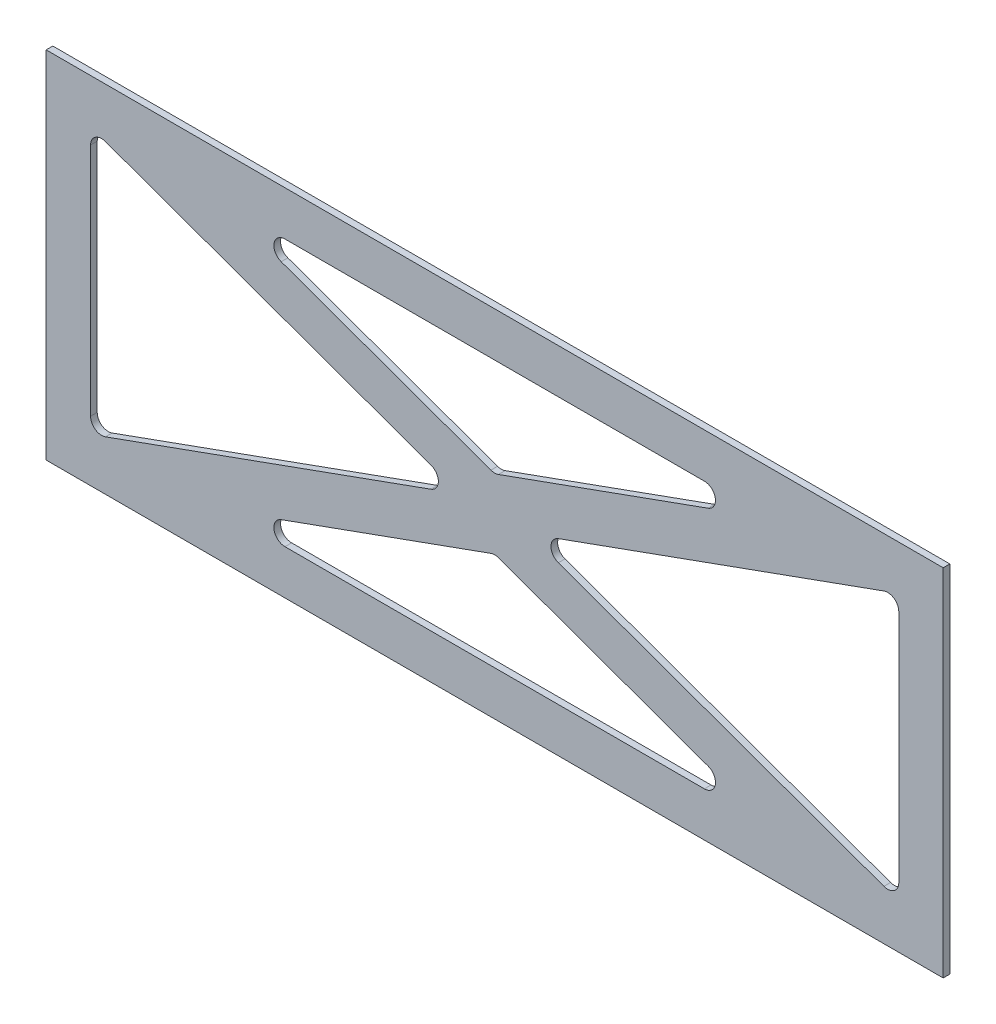
ISO-10303-21;
HEADER;
FILE_DESCRIPTION(('STEP AP214'),'2;1');
FILE_NAME('part.step','',(''),(''),'','','');
FILE_SCHEMA(('AUTOMOTIVE_DESIGN { 1 0 10303 214 1 1 1 1 }'));
ENDSEC;
DATA;
#1=APPLICATION_CONTEXT('core data for automotive mechanical design processes');
#2=APPLICATION_PROTOCOL_DEFINITION('international standard','automotive_design',2000,#1);
#3=PRODUCT_CONTEXT('',#1,'mechanical');
#4=PRODUCT('Part','Part','',(#3));
#5=PRODUCT_RELATED_PRODUCT_CATEGORY('part','',(#4));
#6=PRODUCT_DEFINITION_FORMATION('','',#4);
#7=PRODUCT_DEFINITION_CONTEXT('part definition',#1,'design');
#8=PRODUCT_DEFINITION('design','',#6,#7);
#9=PRODUCT_DEFINITION_SHAPE('','',#8);
#10=(LENGTH_UNIT() NAMED_UNIT(*) SI_UNIT(.MILLI.,.METRE.));
#11=(NAMED_UNIT(*) PLANE_ANGLE_UNIT() SI_UNIT($,.RADIAN.));
#12=(NAMED_UNIT(*) SI_UNIT($,.STERADIAN.) SOLID_ANGLE_UNIT());
#13=UNCERTAINTY_MEASURE_WITH_UNIT(LENGTH_MEASURE(1.E-05),#10,'distance_accuracy_value','');
#14=(GEOMETRIC_REPRESENTATION_CONTEXT(3) GLOBAL_UNCERTAINTY_ASSIGNED_CONTEXT((#13)) GLOBAL_UNIT_ASSIGNED_CONTEXT((#10,
#11,#12)) REPRESENTATION_CONTEXT('',''));
#15=CARTESIAN_POINT('',(0.,0.,0.));
#16=DIRECTION('',(0.,0.,1.));
#17=DIRECTION('',(1.,0.,0.));
#18=AXIS2_PLACEMENT_3D('',#15,#16,#17);
#19=CARTESIAN_POINT('',(0.,0.,154.999999999998));
#20=DIRECTION('',(0.,0.,1.));
#21=DIRECTION('',(1.,0.,0.));
#22=AXIS2_PLACEMENT_3D('',#19,#20,#21);
#23=PLANE('',#22);
#24=DIRECTION('',(0.,-1.,0.));
#25=VECTOR('',#24,1.);
#26=CARTESIAN_POINT('',(-67.5000000000117,-5.9413417365057,154.999999999998));
#27=LINE('',#26,#25);
#28=CARTESIAN_POINT('',(-67.5000000000117,-5.9413417365057,154.999999999998));
#29=VERTEX_POINT('',#28);
#30=CARTESIAN_POINT('',(-67.5000000000117,-165.941341736506,154.999999999998));
#31=VERTEX_POINT('',#30);
#32=EDGE_CURVE('E410',#29,#31,#27,.T.);
#33=ORIENTED_EDGE('',*,*,#32,.T.);
#34=DIRECTION('',(1.,0.,0.));
#35=VECTOR('',#34,1.);
#36=CARTESIAN_POINT('',(-67.5000000000117,-165.941341736506,154.999999999998));
#37=LINE('',#36,#35);
#38=CARTESIAN_POINT('',(336.499999999989,-165.941341736506,154.999999999998));
#39=VERTEX_POINT('',#38);
#40=EDGE_CURVE('E413',#31,#39,#37,.T.);
#41=ORIENTED_EDGE('',*,*,#40,.T.);
#42=DIRECTION('',(0.,1.,0.));
#43=VECTOR('',#42,1.);
#44=CARTESIAN_POINT('',(336.499999999989,-5.9413417365057,154.999999999998));
#45=LINE('',#44,#43);
#46=CARTESIAN_POINT('',(336.499999999989,-5.9413417365057,154.999999999998));
#47=VERTEX_POINT('',#46);
#48=EDGE_CURVE('E416',#39,#47,#45,.T.);
#49=ORIENTED_EDGE('',*,*,#48,.T.);
#50=DIRECTION('',(-1.,0.,0.));
#51=VECTOR('',#50,1.);
#52=CARTESIAN_POINT('',(-67.5000000000117,-5.9413417365057,154.999999999998));
#53=LINE('',#52,#51);
#54=EDGE_CURVE('E418',#47,#29,#53,.T.);
#55=ORIENTED_EDGE('',*,*,#54,.T.);
#56=EDGE_LOOP('',(#33,#41,#49,#55));
#57=FACE_BOUND('',#56,.T.);
#58=DIRECTION('',(0.940697615357116,0.339246218050305,0.));
#59=VECTOR('',#58,1.);
#60=CARTESIAN_POINT('',(105.831987612657,-90.6448298132913,154.999999999998));
#61=LINE('',#60,#59);
#62=CARTESIAN_POINT('',(-40.8037689097602,-143.526462570796,154.999999999998));
#63=VERTEX_POINT('',#62);
#64=CARTESIAN_POINT('',(105.831987612657,-90.6448298132913,154.999999999998));
#65=VERTEX_POINT('',#64);
#66=EDGE_CURVE('E367',#63,#65,#61,.T.);
#67=ORIENTED_EDGE('',*,*,#66,.F.);
#68=CARTESIAN_POINT('',(-42.5000000000117,-138.82297449401,154.999999999998));
#69=DIRECTION('',(0.,0.,1.));
#70=DIRECTION('',(-1.,0.,0.));
#71=AXIS2_PLACEMENT_3D('',#68,#69,#70);
#72=CIRCLE('',#71,4.99999999999998);
#73=CARTESIAN_POINT('',(-47.5000000000117,-138.82297449401,154.999999999998));
#74=VERTEX_POINT('',#73);
#75=EDGE_CURVE('E365',#74,#63,#72,.T.);
#76=ORIENTED_EDGE('',*,*,#75,.F.);
#77=DIRECTION('',(0.,-1.,0.));
#78=VECTOR('',#77,1.);
#79=CARTESIAN_POINT('',(-47.5000000000117,-138.82297449401,154.999999999998));
#80=LINE('',#79,#78);
#81=CARTESIAN_POINT('',(-47.5000000000117,-33.059708979001,154.999999999998));
#82=VERTEX_POINT('',#81);
#83=EDGE_CURVE('E377',#82,#74,#80,.T.);
#84=ORIENTED_EDGE('',*,*,#83,.F.);
#85=CARTESIAN_POINT('',(-42.5000000000117,-33.059708979001,154.999999999998));
#86=DIRECTION('',(0.,0.,1.));
#87=DIRECTION('',(1.,0.,0.));
#88=AXIS2_PLACEMENT_3D('',#85,#86,#87);
#89=CIRCLE('',#88,4.99999999999999);
#90=CARTESIAN_POINT('',(-40.8037689097602,-28.3562209022154,154.999999999998));
#91=VERTEX_POINT('',#90);
#92=EDGE_CURVE('E374',#91,#82,#89,.T.);
#93=ORIENTED_EDGE('',*,*,#92,.F.);
#94=DIRECTION('',(-0.940697615357116,0.339246218050305,0.));
#95=VECTOR('',#94,1.);
#96=CARTESIAN_POINT('',(-40.8037689097602,-28.3562209022154,154.999999999998));
#97=LINE('',#96,#95);
#98=CARTESIAN_POINT('',(105.831987612657,-81.2378536597201,154.999999999998));
#99=VERTEX_POINT('',#98);
#100=EDGE_CURVE('E372',#99,#91,#97,.T.);
#101=ORIENTED_EDGE('',*,*,#100,.F.);
#102=CARTESIAN_POINT('',(104.135756522406,-85.9413417365057,154.999999999998));
#103=DIRECTION('',(0.,0.,1.));
#104=DIRECTION('',(1.,0.,0.));
#105=AXIS2_PLACEMENT_3D('',#102,#103,#104);
#106=CIRCLE('',#105,5.);
#107=EDGE_CURVE('E370',#65,#99,#106,.T.);
#108=ORIENTED_EDGE('',*,*,#107,.F.);
#109=EDGE_LOOP('',(#67,#76,#84,#93,#101,#108));
#110=FACE_BOUND('',#109,.T.);
#111=DIRECTION('',(-0.940697615357116,0.339246218050304,0.));
#112=VECTOR('',#111,1.);
#113=CARTESIAN_POINT('',(136.19623109024,-102.178743606372,154.999999999998));
#114=LINE('',#113,#112);
#115=CARTESIAN_POINT('',(230.638915794301,-136.23785365972,154.999999999998));
#116=VERTEX_POINT('',#115);
#117=CARTESIAN_POINT('',(136.19623109024,-102.178743606372,154.999999999998));
#118=VERTEX_POINT('',#117);
#119=EDGE_CURVE('E322',#116,#118,#114,.T.);
#120=ORIENTED_EDGE('',*,*,#119,.F.);
#121=CARTESIAN_POINT('',(228.942684704049,-140.941341736506,154.999999999998));
#122=DIRECTION('',(0.,0.,1.));
#123=DIRECTION('',(-1.,0.,0.));
#124=AXIS2_PLACEMENT_3D('',#121,#122,#123);
#125=CIRCLE('',#124,5.00000000000001);
#126=CARTESIAN_POINT('',(228.942684704049,-145.941341736506,154.999999999998));
#127=VERTEX_POINT('',#126);
#128=EDGE_CURVE('E320',#127,#116,#125,.T.);
#129=ORIENTED_EDGE('',*,*,#128,.F.);
#130=DIRECTION('',(1.,0.,0.));
#131=VECTOR('',#130,1.);
#132=CARTESIAN_POINT('',(228.942684704049,-145.941341736506,154.999999999998));
#133=LINE('',#132,#131);
#134=CARTESIAN_POINT('',(40.0573152959278,-145.941341736506,154.999999999998));
#135=VERTEX_POINT('',#134);
#136=EDGE_CURVE('E332',#135,#127,#133,.T.);
#137=ORIENTED_EDGE('',*,*,#136,.F.);
#138=CARTESIAN_POINT('',(40.0573152959278,-140.941341736506,154.999999999998));
#139=DIRECTION('',(0.,0.,1.));
#140=DIRECTION('',(1.,0.,0.));
#141=AXIS2_PLACEMENT_3D('',#138,#139,#140);
#142=CIRCLE('',#141,4.99999999999999);
#143=CARTESIAN_POINT('',(38.3610842056763,-136.23785365972,154.999999999998));
#144=VERTEX_POINT('',#143);
#145=EDGE_CURVE('E329',#144,#135,#142,.T.);
#146=ORIENTED_EDGE('',*,*,#145,.F.);
#147=DIRECTION('',(-0.940697615357116,-0.339246218050305,0.));
#148=VECTOR('',#147,1.);
#149=CARTESIAN_POINT('',(38.3610842056763,-136.23785365972,154.999999999998));
#150=LINE('',#149,#148);
#151=CARTESIAN_POINT('',(132.803768909737,-102.178743606372,154.999999999998));
#152=VERTEX_POINT('',#151);
#153=EDGE_CURVE('E327',#152,#144,#150,.T.);
#154=ORIENTED_EDGE('',*,*,#153,.F.);
#155=CARTESIAN_POINT('',(134.499999999989,-106.882231683158,154.999999999998));
#156=DIRECTION('',(0.,0.,1.));
#157=DIRECTION('',(-1.,0.,0.));
#158=AXIS2_PLACEMENT_3D('',#155,#156,#157);
#159=CIRCLE('',#158,5.);
#160=EDGE_CURVE('E325',#118,#152,#159,.T.);
#161=ORIENTED_EDGE('',*,*,#160,.F.);
#162=EDGE_LOOP('',(#120,#129,#137,#146,#154,#161));
#163=FACE_BOUND('',#162,.T.);
#164=DIRECTION('',(0.940697615357116,-0.339246218050305,0.));
#165=VECTOR('',#164,1.);
#166=CARTESIAN_POINT('',(163.16801238732,-90.6448298132913,154.999999999998));
#167=LINE('',#166,#165);
#168=CARTESIAN_POINT('',(163.16801238732,-90.6448298132913,154.999999999998));
#169=VERTEX_POINT('',#168);
#170=CARTESIAN_POINT('',(309.803768909737,-143.526462570796,154.999999999998));
#171=VERTEX_POINT('',#170);
#172=EDGE_CURVE('E277',#169,#171,#167,.T.);
#173=ORIENTED_EDGE('',*,*,#172,.F.);
#174=CARTESIAN_POINT('',(164.864243477571,-85.9413417365057,154.999999999998));
#175=DIRECTION('',(0.,0.,1.));
#176=DIRECTION('',(1.,0.,0.));
#177=AXIS2_PLACEMENT_3D('',#174,#175,#176);
#178=CIRCLE('',#177,4.99999999999998);
#179=CARTESIAN_POINT('',(163.16801238732,-81.2378536597201,154.999999999998));
#180=VERTEX_POINT('',#179);
#181=EDGE_CURVE('E275',#180,#169,#178,.T.);
#182=ORIENTED_EDGE('',*,*,#181,.F.);
#183=DIRECTION('',(-0.940697615357116,-0.339246218050305,0.));
#184=VECTOR('',#183,1.);
#185=CARTESIAN_POINT('',(309.803768909737,-28.3562209022154,154.999999999998));
#186=LINE('',#185,#184);
#187=CARTESIAN_POINT('',(309.803768909737,-28.3562209022154,154.999999999998));
#188=VERTEX_POINT('',#187);
#189=EDGE_CURVE('E287',#188,#180,#186,.T.);
#190=ORIENTED_EDGE('',*,*,#189,.F.);
#191=CARTESIAN_POINT('',(311.499999999989,-33.059708979001,154.999999999998));
#192=DIRECTION('',(0.,0.,1.));
#193=DIRECTION('',(1.,0.,0.));
#194=AXIS2_PLACEMENT_3D('',#191,#192,#193);
#195=CIRCLE('',#194,5.);
#196=CARTESIAN_POINT('',(316.499999999989,-33.059708979001,154.999999999998));
#197=VERTEX_POINT('',#196);
#198=EDGE_CURVE('E284',#197,#188,#195,.T.);
#199=ORIENTED_EDGE('',*,*,#198,.F.);
#200=DIRECTION('',(0.,1.,0.));
#201=VECTOR('',#200,1.);
#202=CARTESIAN_POINT('',(316.499999999989,-138.82297449401,154.999999999998));
#203=LINE('',#202,#201);
#204=CARTESIAN_POINT('',(316.499999999989,-138.82297449401,154.999999999998));
#205=VERTEX_POINT('',#204);
#206=EDGE_CURVE('E282',#205,#197,#203,.T.);
#207=ORIENTED_EDGE('',*,*,#206,.F.);
#208=CARTESIAN_POINT('',(311.499999999989,-138.82297449401,154.999999999998));
#209=DIRECTION('',(0.,0.,1.));
#210=DIRECTION('',(1.,0.,0.));
#211=AXIS2_PLACEMENT_3D('',#208,#209,#210);
#212=CIRCLE('',#211,5.00000000000003);
#213=EDGE_CURVE('E280',#171,#205,#212,.T.);
#214=ORIENTED_EDGE('',*,*,#213,.F.);
#215=EDGE_LOOP('',(#173,#182,#190,#199,#207,#214));
#216=FACE_BOUND('',#215,.T.);
#217=DIRECTION('',(0.940697615357116,-0.339246218050304,0.));
#218=VECTOR('',#217,1.);
#219=CARTESIAN_POINT('',(38.3610842056763,-35.6448298132913,154.999999999998));
#220=LINE('',#219,#218);
#221=CARTESIAN_POINT('',(38.3610842056763,-35.6448298132913,154.999999999998));
#222=VERTEX_POINT('',#221);
#223=CARTESIAN_POINT('',(132.803768909737,-69.7039398666392,154.999999999998));
#224=VERTEX_POINT('',#223);
#225=EDGE_CURVE('E232',#222,#224,#220,.T.);
#226=ORIENTED_EDGE('',*,*,#225,.F.);
#227=CARTESIAN_POINT('',(40.0573152959278,-30.9413417365057,154.999999999998));
#228=DIRECTION('',(0.,0.,1.));
#229=DIRECTION('',(-1.,0.,0.));
#230=AXIS2_PLACEMENT_3D('',#227,#228,#229);
#231=CIRCLE('',#230,5.);
#232=CARTESIAN_POINT('',(40.0573152959278,-25.9413417365057,154.999999999998));
#233=VERTEX_POINT('',#232);
#234=EDGE_CURVE('E224',#233,#222,#231,.T.);
#235=ORIENTED_EDGE('',*,*,#234,.F.);
#236=DIRECTION('',(-1.,0.,0.));
#237=VECTOR('',#236,1.);
#238=CARTESIAN_POINT('',(228.942684704049,-25.9413417365057,154.999999999998));
#239=LINE('',#238,#237);
#240=CARTESIAN_POINT('',(228.942684704049,-25.9413417365057,154.999999999998));
#241=VERTEX_POINT('',#240);
#242=EDGE_CURVE('E253',#241,#233,#239,.T.);
#243=ORIENTED_EDGE('',*,*,#242,.F.);
#244=CARTESIAN_POINT('',(228.942684704049,-30.9413417365057,154.999999999998));
#245=DIRECTION('',(0.,0.,1.));
#246=DIRECTION('',(1.,0.,0.));
#247=AXIS2_PLACEMENT_3D('',#244,#245,#246);
#248=CIRCLE('',#247,5.00000000000002);
#249=CARTESIAN_POINT('',(230.638915794301,-35.6448298132913,154.999999999998));
#250=VERTEX_POINT('',#249);
#251=EDGE_CURVE('E251',#250,#241,#248,.T.);
#252=ORIENTED_EDGE('',*,*,#251,.F.);
#253=DIRECTION('',(0.940697615357116,0.339246218050304,0.));
#254=VECTOR('',#253,1.);
#255=CARTESIAN_POINT('',(136.19623109024,-69.7039398666392,154.999999999998));
#256=LINE('',#255,#254);
#257=CARTESIAN_POINT('',(136.19623109024,-69.7039398666392,154.999999999998));
#258=VERTEX_POINT('',#257);
#259=EDGE_CURVE('E247',#258,#250,#256,.T.);
#260=ORIENTED_EDGE('',*,*,#259,.F.);
#261=CARTESIAN_POINT('',(134.499999999989,-65.0004517898536,154.999999999998));
#262=DIRECTION('',(0.,0.,1.));
#263=DIRECTION('',(-1.,0.,0.));
#264=AXIS2_PLACEMENT_3D('',#261,#262,#263);
#265=CIRCLE('',#264,5.);
#266=EDGE_CURVE('E245',#224,#258,#265,.T.);
#267=ORIENTED_EDGE('',*,*,#266,.F.);
#268=EDGE_LOOP('',(#226,#235,#243,#252,#260,#267));
#269=FACE_BOUND('',#268,.T.);
#270=ADVANCED_FACE('F39',(#57,#110,#163,#216,#269),#23,.T.);
#271=CARTESIAN_POINT('',(0.,0.,151.999999999998));
#272=DIRECTION('',(0.,0.,1.));
#273=DIRECTION('',(1.,0.,0.));
#274=AXIS2_PLACEMENT_3D('',#271,#272,#273);
#275=PLANE('',#274);
#276=CARTESIAN_POINT('',(164.864243477571,-85.9413417365057,151.999999999998));
#277=DIRECTION('',(0.,0.,1.));
#278=DIRECTION('',(1.,0.,0.));
#279=AXIS2_PLACEMENT_3D('',#276,#277,#278);
#280=CIRCLE('',#279,4.99999999999998);
#281=CARTESIAN_POINT('',(163.16801238732,-81.2378536597202,151.999999999998));
#282=VERTEX_POINT('',#281);
#283=CARTESIAN_POINT('',(163.16801238732,-90.6448298132913,151.999999999998));
#284=VERTEX_POINT('',#283);
#285=EDGE_CURVE('E240',#282,#284,#280,.T.);
#286=ORIENTED_EDGE('',*,*,#285,.T.);
#287=DIRECTION('',(0.940697615357116,-0.339246218050305,0.));
#288=VECTOR('',#287,1.);
#289=CARTESIAN_POINT('',(163.16801238732,-90.6448298132913,151.999999999998));
#290=LINE('',#289,#288);
#291=CARTESIAN_POINT('',(309.803768909737,-143.526462570796,151.999999999998));
#292=VERTEX_POINT('',#291);
#293=EDGE_CURVE('E292',#284,#292,#290,.T.);
#294=ORIENTED_EDGE('',*,*,#293,.T.);
#295=CARTESIAN_POINT('',(311.499999999989,-138.82297449401,151.999999999998));
#296=DIRECTION('',(0.,0.,1.));
#297=DIRECTION('',(1.,0.,0.));
#298=AXIS2_PLACEMENT_3D('',#295,#296,#297);
#299=CIRCLE('',#298,5.00000000000003);
#300=CARTESIAN_POINT('',(316.499999999989,-138.82297449401,151.999999999998));
#301=VERTEX_POINT('',#300);
#302=EDGE_CURVE('E295',#292,#301,#299,.T.);
#303=ORIENTED_EDGE('',*,*,#302,.T.);
#304=DIRECTION('',(0.,1.,0.));
#305=VECTOR('',#304,1.);
#306=CARTESIAN_POINT('',(316.499999999989,-138.82297449401,151.999999999998));
#307=LINE('',#306,#305);
#308=CARTESIAN_POINT('',(316.499999999989,-33.059708979001,151.999999999998));
#309=VERTEX_POINT('',#308);
#310=EDGE_CURVE('E298',#301,#309,#307,.T.);
#311=ORIENTED_EDGE('',*,*,#310,.T.);
#312=CARTESIAN_POINT('',(311.499999999989,-33.059708979001,151.999999999998));
#313=DIRECTION('',(0.,0.,1.));
#314=DIRECTION('',(1.,0.,0.));
#315=AXIS2_PLACEMENT_3D('',#312,#313,#314);
#316=CIRCLE('',#315,5.);
#317=CARTESIAN_POINT('',(309.803768909737,-28.3562209022154,151.999999999998));
#318=VERTEX_POINT('',#317);
#319=EDGE_CURVE('E301',#309,#318,#316,.T.);
#320=ORIENTED_EDGE('',*,*,#319,.T.);
#321=DIRECTION('',(-0.940697615357116,-0.339246218050305,0.));
#322=VECTOR('',#321,1.);
#323=CARTESIAN_POINT('',(309.803768909737,-28.3562209022154,151.999999999998));
#324=LINE('',#323,#322);
#325=EDGE_CURVE('E278',#318,#282,#324,.T.);
#326=ORIENTED_EDGE('',*,*,#325,.T.);
#327=EDGE_LOOP('',(#286,#294,#303,#311,#320,#326));
#328=FACE_BOUND('',#327,.T.);
#329=CARTESIAN_POINT('',(-42.5000000000117,-138.82297449401,151.999999999998));
#330=DIRECTION('',(0.,0.,1.));
#331=DIRECTION('',(-1.,0.,0.));
#332=AXIS2_PLACEMENT_3D('',#329,#330,#331);
#333=CIRCLE('',#332,4.99999999999998);
#334=CARTESIAN_POINT('',(-47.5000000000117,-138.82297449401,151.999999999998));
#335=VERTEX_POINT('',#334);
#336=CARTESIAN_POINT('',(-40.8037689097602,-143.526462570796,151.999999999998));
#337=VERTEX_POINT('',#336);
#338=EDGE_CURVE('E364',#335,#337,#333,.T.);
#339=ORIENTED_EDGE('',*,*,#338,.T.);
#340=DIRECTION('',(0.940697615357116,0.339246218050305,0.));
#341=VECTOR('',#340,1.);
#342=CARTESIAN_POINT('',(105.831987612657,-90.6448298132913,151.999999999998));
#343=LINE('',#342,#341);
#344=CARTESIAN_POINT('',(105.831987612657,-90.6448298132913,151.999999999998));
#345=VERTEX_POINT('',#344);
#346=EDGE_CURVE('E382',#337,#345,#343,.T.);
#347=ORIENTED_EDGE('',*,*,#346,.T.);
#348=CARTESIAN_POINT('',(104.135756522406,-85.9413417365057,151.999999999998));
#349=DIRECTION('',(0.,0.,1.));
#350=DIRECTION('',(1.,0.,0.));
#351=AXIS2_PLACEMENT_3D('',#348,#349,#350);
#352=CIRCLE('',#351,5.);
#353=CARTESIAN_POINT('',(105.831987612657,-81.2378536597201,151.999999999998));
#354=VERTEX_POINT('',#353);
#355=EDGE_CURVE('E385',#345,#354,#352,.T.);
#356=ORIENTED_EDGE('',*,*,#355,.T.);
#357=DIRECTION('',(-0.940697615357116,0.339246218050305,0.));
#358=VECTOR('',#357,1.);
#359=CARTESIAN_POINT('',(-40.8037689097602,-28.3562209022154,151.999999999998));
#360=LINE('',#359,#358);
#361=CARTESIAN_POINT('',(-40.8037689097602,-28.3562209022154,151.999999999998));
#362=VERTEX_POINT('',#361);
#363=EDGE_CURVE('E388',#354,#362,#360,.T.);
#364=ORIENTED_EDGE('',*,*,#363,.T.);
#365=CARTESIAN_POINT('',(-42.5000000000117,-33.059708979001,151.999999999998));
#366=DIRECTION('',(0.,0.,1.));
#367=DIRECTION('',(1.,0.,0.));
#368=AXIS2_PLACEMENT_3D('',#365,#366,#367);
#369=CIRCLE('',#368,4.99999999999999);
#370=CARTESIAN_POINT('',(-47.5000000000117,-33.059708979001,151.999999999998));
#371=VERTEX_POINT('',#370);
#372=EDGE_CURVE('E391',#362,#371,#369,.T.);
#373=ORIENTED_EDGE('',*,*,#372,.T.);
#374=DIRECTION('',(0.,-1.,0.));
#375=VECTOR('',#374,1.);
#376=CARTESIAN_POINT('',(-47.5000000000117,-138.82297449401,151.999999999998));
#377=LINE('',#376,#375);
#378=EDGE_CURVE('E368',#371,#335,#377,.T.);
#379=ORIENTED_EDGE('',*,*,#378,.T.);
#380=EDGE_LOOP('',(#339,#347,#356,#364,#373,#379));
#381=FACE_BOUND('',#380,.T.);
#382=DIRECTION('',(0.,-1.,0.));
#383=VECTOR('',#382,1.);
#384=CARTESIAN_POINT('',(-67.5000000000117,-5.9413417365057,151.999999999998));
#385=LINE('',#384,#383);
#386=CARTESIAN_POINT('',(-67.5000000000117,-5.9413417365057,151.999999999998));
#387=VERTEX_POINT('',#386);
#388=CARTESIAN_POINT('',(-67.5000000000117,-165.941341736506,151.999999999998));
#389=VERTEX_POINT('',#388);
#390=EDGE_CURVE('E409',#387,#389,#385,.T.);
#391=ORIENTED_EDGE('',*,*,#390,.F.);
#392=DIRECTION('',(-1.,0.,0.));
#393=VECTOR('',#392,1.);
#394=CARTESIAN_POINT('',(-67.5000000000117,-5.9413417365057,151.999999999998));
#395=LINE('',#394,#393);
#396=CARTESIAN_POINT('',(336.499999999989,-5.9413417365057,151.999999999998));
#397=VERTEX_POINT('',#396);
#398=EDGE_CURVE('E414',#397,#387,#395,.T.);
#399=ORIENTED_EDGE('',*,*,#398,.F.);
#400=DIRECTION('',(0.,1.,0.));
#401=VECTOR('',#400,1.);
#402=CARTESIAN_POINT('',(336.499999999989,-5.9413417365057,151.999999999998));
#403=LINE('',#402,#401);
#404=CARTESIAN_POINT('',(336.499999999989,-165.941341736506,151.999999999998));
#405=VERTEX_POINT('',#404);
#406=EDGE_CURVE('E425',#405,#397,#403,.T.);
#407=ORIENTED_EDGE('',*,*,#406,.F.);
#408=DIRECTION('',(1.,0.,0.));
#409=VECTOR('',#408,1.);
#410=CARTESIAN_POINT('',(-67.5000000000117,-165.941341736506,151.999999999998));
#411=LINE('',#410,#409);
#412=EDGE_CURVE('E423',#389,#405,#411,.T.);
#413=ORIENTED_EDGE('',*,*,#412,.F.);
#414=EDGE_LOOP('',(#391,#399,#407,#413));
#415=FACE_BOUND('',#414,.T.);
#416=CARTESIAN_POINT('',(228.942684704049,-140.941341736506,151.999999999998));
#417=DIRECTION('',(0.,0.,1.));
#418=DIRECTION('',(-1.,0.,0.));
#419=AXIS2_PLACEMENT_3D('',#416,#417,#418);
#420=CIRCLE('',#419,5.00000000000001);
#421=CARTESIAN_POINT('',(228.942684704049,-145.941341736506,151.999999999998));
#422=VERTEX_POINT('',#421);
#423=CARTESIAN_POINT('',(230.638915794301,-136.23785365972,151.999999999998));
#424=VERTEX_POINT('',#423);
#425=EDGE_CURVE('E319',#422,#424,#420,.T.);
#426=ORIENTED_EDGE('',*,*,#425,.T.);
#427=DIRECTION('',(-0.940697615357116,0.339246218050304,0.));
#428=VECTOR('',#427,1.);
#429=CARTESIAN_POINT('',(136.19623109024,-102.178743606372,151.999999999998));
#430=LINE('',#429,#428);
#431=CARTESIAN_POINT('',(136.19623109024,-102.178743606372,151.999999999998));
#432=VERTEX_POINT('',#431);
#433=EDGE_CURVE('E337',#424,#432,#430,.T.);
#434=ORIENTED_EDGE('',*,*,#433,.T.);
#435=CARTESIAN_POINT('',(134.499999999989,-106.882231683158,151.999999999998));
#436=DIRECTION('',(0.,0.,1.));
#437=DIRECTION('',(-1.,0.,0.));
#438=AXIS2_PLACEMENT_3D('',#435,#436,#437);
#439=CIRCLE('',#438,5.);
#440=CARTESIAN_POINT('',(132.803768909737,-102.178743606372,151.999999999998));
#441=VERTEX_POINT('',#440);
#442=EDGE_CURVE('E340',#432,#441,#439,.T.);
#443=ORIENTED_EDGE('',*,*,#442,.T.);
#444=DIRECTION('',(-0.940697615357116,-0.339246218050305,0.));
#445=VECTOR('',#444,1.);
#446=CARTESIAN_POINT('',(38.3610842056763,-136.23785365972,151.999999999998));
#447=LINE('',#446,#445);
#448=CARTESIAN_POINT('',(38.3610842056763,-136.23785365972,151.999999999998));
#449=VERTEX_POINT('',#448);
#450=EDGE_CURVE('E343',#441,#449,#447,.T.);
#451=ORIENTED_EDGE('',*,*,#450,.T.);
#452=CARTESIAN_POINT('',(40.0573152959278,-140.941341736506,151.999999999998));
#453=DIRECTION('',(0.,0.,1.));
#454=DIRECTION('',(1.,0.,0.));
#455=AXIS2_PLACEMENT_3D('',#452,#453,#454);
#456=CIRCLE('',#455,4.99999999999999);
#457=CARTESIAN_POINT('',(40.0573152959278,-145.941341736506,151.999999999998));
#458=VERTEX_POINT('',#457);
#459=EDGE_CURVE('E346',#449,#458,#456,.T.);
#460=ORIENTED_EDGE('',*,*,#459,.T.);
#461=DIRECTION('',(1.,0.,0.));
#462=VECTOR('',#461,1.);
#463=CARTESIAN_POINT('',(228.942684704049,-145.941341736506,151.999999999998));
#464=LINE('',#463,#462);
#465=EDGE_CURVE('E323',#458,#422,#464,.T.);
#466=ORIENTED_EDGE('',*,*,#465,.T.);
#467=EDGE_LOOP('',(#426,#434,#443,#451,#460,#466));
#468=FACE_BOUND('',#467,.T.);
#469=CARTESIAN_POINT('',(40.0573152959278,-30.9413417365057,151.999999999998));
#470=DIRECTION('',(0.,0.,1.));
#471=DIRECTION('',(-1.,0.,0.));
#472=AXIS2_PLACEMENT_3D('',#469,#470,#471);
#473=CIRCLE('',#472,5.);
#474=CARTESIAN_POINT('',(40.0573152959278,-25.9413417365057,151.999999999998));
#475=VERTEX_POINT('',#474);
#476=CARTESIAN_POINT('',(38.3610842056763,-35.6448298132913,151.999999999998));
#477=VERTEX_POINT('',#476);
#478=EDGE_CURVE('E62',#475,#477,#473,.T.);
#479=ORIENTED_EDGE('',*,*,#478,.T.);
#480=DIRECTION('',(0.940697615357116,-0.339246218050304,0.));
#481=VECTOR('',#480,1.);
#482=CARTESIAN_POINT('',(38.3610842056763,-35.6448298132913,151.999999999998));
#483=LINE('',#482,#481);
#484=CARTESIAN_POINT('',(132.803768909737,-69.7039398666392,151.999999999998));
#485=VERTEX_POINT('',#484);
#486=EDGE_CURVE('E239',#477,#485,#483,.T.);
#487=ORIENTED_EDGE('',*,*,#486,.T.);
#488=CARTESIAN_POINT('',(134.499999999989,-65.0004517898536,151.999999999998));
#489=DIRECTION('',(0.,0.,1.));
#490=DIRECTION('',(-1.,0.,0.));
#491=AXIS2_PLACEMENT_3D('',#488,#489,#490);
#492=CIRCLE('',#491,5.);
#493=CARTESIAN_POINT('',(136.19623109024,-69.7039398666392,151.999999999998));
#494=VERTEX_POINT('',#493);
#495=EDGE_CURVE('E257',#485,#494,#492,.T.);
#496=ORIENTED_EDGE('',*,*,#495,.T.);
#497=DIRECTION('',(0.940697615357116,0.339246218050304,0.));
#498=VECTOR('',#497,1.);
#499=CARTESIAN_POINT('',(136.19623109024,-69.7039398666392,151.999999999998));
#500=LINE('',#499,#498);
#501=CARTESIAN_POINT('',(230.638915794301,-35.6448298132913,151.999999999998));
#502=VERTEX_POINT('',#501);
#503=EDGE_CURVE('E260',#494,#502,#500,.T.);
#504=ORIENTED_EDGE('',*,*,#503,.T.);
#505=CARTESIAN_POINT('',(228.942684704049,-30.9413417365057,151.999999999998));
#506=DIRECTION('',(0.,0.,1.));
#507=DIRECTION('',(1.,0.,0.));
#508=AXIS2_PLACEMENT_3D('',#505,#506,#507);
#509=CIRCLE('',#508,5.00000000000002);
#510=CARTESIAN_POINT('',(228.942684704049,-25.9413417365057,151.999999999998));
#511=VERTEX_POINT('',#510);
#512=EDGE_CURVE('E263',#502,#511,#509,.T.);
#513=ORIENTED_EDGE('',*,*,#512,.T.);
#514=DIRECTION('',(-1.,0.,0.));
#515=VECTOR('',#514,1.);
#516=CARTESIAN_POINT('',(228.942684704049,-25.9413417365057,151.999999999998));
#517=LINE('',#516,#515);
#518=EDGE_CURVE('E233',#511,#475,#517,.T.);
#519=ORIENTED_EDGE('',*,*,#518,.T.);
#520=EDGE_LOOP('',(#479,#487,#496,#504,#513,#519));
#521=FACE_BOUND('',#520,.T.);
#522=ADVANCED_FACE('F443',(#328,#381,#415,#468,#521),#275,.F.);
#523=CARTESIAN_POINT('',(-67.5000000000117,-5.9413417365057,154.999999999998));
#524=DIRECTION('',(1.,0.,0.));
#525=DIRECTION('',(0.,0.,-1.));
#526=AXIS2_PLACEMENT_3D('',#523,#524,#525);
#527=PLANE('',#526);
#528=ORIENTED_EDGE('',*,*,#390,.T.);
#529=DIRECTION('',(0.,0.,-1.));
#530=VECTOR('',#529,1.);
#531=CARTESIAN_POINT('',(-67.5000000000117,-165.941341736506,154.999999999998));
#532=LINE('',#531,#530);
#533=EDGE_CURVE('E11',#31,#389,#532,.T.);
#534=ORIENTED_EDGE('',*,*,#533,.F.);
#535=ORIENTED_EDGE('',*,*,#32,.F.);
#536=DIRECTION('',(0.,0.,-1.));
#537=VECTOR('',#536,1.);
#538=CARTESIAN_POINT('',(-67.5000000000117,-5.9413417365057,154.999999999998));
#539=LINE('',#538,#537);
#540=EDGE_CURVE('E420',#29,#387,#539,.T.);
#541=ORIENTED_EDGE('',*,*,#540,.T.);
#542=EDGE_LOOP('',(#528,#534,#535,#541));
#543=FACE_BOUND('',#542,.T.);
#544=ADVANCED_FACE('F41',(#543),#527,.F.);
#545=CARTESIAN_POINT('',(-67.5000000000117,-165.941341736506,154.999999999998));
#546=DIRECTION('',(0.,1.,0.));
#547=DIRECTION('',(-1.,0.,0.));
#548=AXIS2_PLACEMENT_3D('',#545,#546,#547);
#549=PLANE('',#548);
#550=ORIENTED_EDGE('',*,*,#412,.T.);
#551=DIRECTION('',(0.,0.,-1.));
#552=VECTOR('',#551,1.);
#553=CARTESIAN_POINT('',(336.499999999989,-165.941341736506,154.999999999998));
#554=LINE('',#553,#552);
#555=EDGE_CURVE('E47',#39,#405,#554,.T.);
#556=ORIENTED_EDGE('',*,*,#555,.F.);
#557=ORIENTED_EDGE('',*,*,#40,.F.);
#558=ORIENTED_EDGE('',*,*,#533,.T.);
#559=EDGE_LOOP('',(#550,#556,#557,#558));
#560=FACE_BOUND('',#559,.T.);
#561=ADVANCED_FACE('F454',(#560),#549,.F.);
#562=CARTESIAN_POINT('',(336.499999999989,-5.9413417365057,154.999999999998));
#563=DIRECTION('',(-1.,0.,0.));
#564=DIRECTION('',(0.,0.,1.));
#565=AXIS2_PLACEMENT_3D('',#562,#563,#564);
#566=PLANE('',#565);
#567=ORIENTED_EDGE('',*,*,#406,.T.);
#568=DIRECTION('',(0.,0.,-1.));
#569=VECTOR('',#568,1.);
#570=CARTESIAN_POINT('',(336.499999999989,-5.9413417365057,154.999999999998));
#571=LINE('',#570,#569);
#572=EDGE_CURVE('E430',#47,#397,#571,.T.);
#573=ORIENTED_EDGE('',*,*,#572,.F.);
#574=ORIENTED_EDGE('',*,*,#48,.F.);
#575=ORIENTED_EDGE('',*,*,#555,.T.);
#576=EDGE_LOOP('',(#567,#573,#574,#575));
#577=FACE_BOUND('',#576,.T.);
#578=ADVANCED_FACE('F437',(#577),#566,.F.);
#579=CARTESIAN_POINT('',(-67.5000000000117,-5.9413417365057,154.999999999998));
#580=DIRECTION('',(0.,-1.,0.));
#581=DIRECTION('',(0.,0.,-1.));
#582=AXIS2_PLACEMENT_3D('',#579,#580,#581);
#583=PLANE('',#582);
#584=ORIENTED_EDGE('',*,*,#398,.T.);
#585=ORIENTED_EDGE('',*,*,#540,.F.);
#586=ORIENTED_EDGE('',*,*,#54,.F.);
#587=ORIENTED_EDGE('',*,*,#572,.T.);
#588=EDGE_LOOP('',(#584,#585,#586,#587));
#589=FACE_BOUND('',#588,.T.);
#590=ADVANCED_FACE('F447',(#589),#583,.F.);
#591=CARTESIAN_POINT('',(-42.5000000000117,-138.82297449401,154.999999999998));
#592=DIRECTION('',(0.,0.,-1.));
#593=DIRECTION('',(-1.,0.,0.));
#594=AXIS2_PLACEMENT_3D('',#591,#592,#593);
#595=CYLINDRICAL_SURFACE('',#594,4.99999999999998);
#596=ORIENTED_EDGE('',*,*,#338,.F.);
#597=DIRECTION('',(0.,0.,-1.));
#598=VECTOR('',#597,1.);
#599=CARTESIAN_POINT('',(-47.5000000000117,-138.82297449401,154.999999999998));
#600=LINE('',#599,#598);
#601=EDGE_CURVE('E379',#74,#335,#600,.T.);
#602=ORIENTED_EDGE('',*,*,#601,.F.);
#603=ORIENTED_EDGE('',*,*,#75,.T.);
#604=DIRECTION('',(0.,0.,-1.));
#605=VECTOR('',#604,1.);
#606=CARTESIAN_POINT('',(-40.8037689097602,-143.526462570796,154.999999999998));
#607=LINE('',#606,#605);
#608=EDGE_CURVE('E406',#63,#337,#607,.T.);
#609=ORIENTED_EDGE('',*,*,#608,.T.);
#610=EDGE_LOOP('',(#596,#602,#603,#609));
#611=FACE_BOUND('',#610,.T.);
#612=ADVANCED_FACE('F469',(#611),#595,.F.);
#613=CARTESIAN_POINT('',(105.831987612657,-90.6448298132913,154.999999999998));
#614=DIRECTION('',(-0.339246218050305,0.940697615357116,0.));
#615=DIRECTION('',(-0.940697615357116,-0.339246218050305,0.));
#616=AXIS2_PLACEMENT_3D('',#613,#614,#615);
#617=PLANE('',#616);
#618=ORIENTED_EDGE('',*,*,#346,.F.);
#619=ORIENTED_EDGE('',*,*,#608,.F.);
#620=ORIENTED_EDGE('',*,*,#66,.T.);
#621=DIRECTION('',(0.,0.,-1.));
#622=VECTOR('',#621,1.);
#623=CARTESIAN_POINT('',(105.831987612657,-90.6448298132913,154.999999999998));
#624=LINE('',#623,#622);
#625=EDGE_CURVE('E404',#65,#345,#624,.T.);
#626=ORIENTED_EDGE('',*,*,#625,.T.);
#627=EDGE_LOOP('',(#618,#619,#620,#626));
#628=FACE_BOUND('',#627,.T.);
#629=ADVANCED_FACE('F476',(#628),#617,.T.);
#630=CARTESIAN_POINT('',(104.135756522406,-85.9413417365057,154.999999999998));
#631=DIRECTION('',(0.,0.,-1.));
#632=DIRECTION('',(-1.,0.,0.));
#633=AXIS2_PLACEMENT_3D('',#630,#631,#632);
#634=CYLINDRICAL_SURFACE('',#633,5.);
#635=ORIENTED_EDGE('',*,*,#355,.F.);
#636=ORIENTED_EDGE('',*,*,#625,.F.);
#637=ORIENTED_EDGE('',*,*,#107,.T.);
#638=DIRECTION('',(0.,0.,-1.));
#639=VECTOR('',#638,1.);
#640=CARTESIAN_POINT('',(105.831987612657,-81.2378536597201,154.999999999998));
#641=LINE('',#640,#639);
#642=EDGE_CURVE('E402',#99,#354,#641,.T.);
#643=ORIENTED_EDGE('',*,*,#642,.T.);
#644=EDGE_LOOP('',(#635,#636,#637,#643));
#645=FACE_BOUND('',#644,.T.);
#646=ADVANCED_FACE('F481',(#645),#634,.F.);
#647=CARTESIAN_POINT('',(-40.8037689097602,-28.3562209022154,154.999999999998));
#648=DIRECTION('',(-0.339246218050305,-0.940697615357116,0.));
#649=DIRECTION('',(0.940697615357116,-0.339246218050305,0.));
#650=AXIS2_PLACEMENT_3D('',#647,#648,#649);
#651=PLANE('',#650);
#652=ORIENTED_EDGE('',*,*,#363,.F.);
#653=ORIENTED_EDGE('',*,*,#642,.F.);
#654=ORIENTED_EDGE('',*,*,#100,.T.);
#655=DIRECTION('',(0.,0.,-1.));
#656=VECTOR('',#655,1.);
#657=CARTESIAN_POINT('',(-40.8037689097602,-28.3562209022154,154.999999999998));
#658=LINE('',#657,#656);
#659=EDGE_CURVE('E400',#91,#362,#658,.T.);
#660=ORIENTED_EDGE('',*,*,#659,.T.);
#661=EDGE_LOOP('',(#652,#653,#654,#660));
#662=FACE_BOUND('',#661,.T.);
#663=ADVANCED_FACE('F506',(#662),#651,.T.);
#664=CARTESIAN_POINT('',(-42.5000000000117,-33.059708979001,154.999999999998));
#665=DIRECTION('',(0.,0.,-1.));
#666=DIRECTION('',(-1.,0.,0.));
#667=AXIS2_PLACEMENT_3D('',#664,#665,#666);
#668=CYLINDRICAL_SURFACE('',#667,4.99999999999999);
#669=ORIENTED_EDGE('',*,*,#372,.F.);
#670=ORIENTED_EDGE('',*,*,#659,.F.);
#671=ORIENTED_EDGE('',*,*,#92,.T.);
#672=DIRECTION('',(0.,0.,-1.));
#673=VECTOR('',#672,1.);
#674=CARTESIAN_POINT('',(-47.5000000000117,-33.059708979001,154.999999999998));
#675=LINE('',#674,#673);
#676=EDGE_CURVE('E398',#82,#371,#675,.T.);
#677=ORIENTED_EDGE('',*,*,#676,.T.);
#678=EDGE_LOOP('',(#669,#670,#671,#677));
#679=FACE_BOUND('',#678,.T.);
#680=ADVANCED_FACE('F495',(#679),#668,.F.);
#681=CARTESIAN_POINT('',(-47.5000000000117,-138.82297449401,154.999999999998));
#682=DIRECTION('',(1.,0.,0.));
#683=DIRECTION('',(0.,0.,-1.));
#684=AXIS2_PLACEMENT_3D('',#681,#682,#683);
#685=PLANE('',#684);
#686=ORIENTED_EDGE('',*,*,#378,.F.);
#687=ORIENTED_EDGE('',*,*,#676,.F.);
#688=ORIENTED_EDGE('',*,*,#83,.T.);
#689=ORIENTED_EDGE('',*,*,#601,.T.);
#690=EDGE_LOOP('',(#686,#687,#688,#689));
#691=FACE_BOUND('',#690,.T.);
#692=ADVANCED_FACE('F489',(#691),#685,.T.);
#693=CARTESIAN_POINT('',(228.942684704049,-140.941341736506,154.999999999998));
#694=DIRECTION('',(0.,0.,-1.));
#695=DIRECTION('',(-1.,0.,0.));
#696=AXIS2_PLACEMENT_3D('',#693,#694,#695);
#697=CYLINDRICAL_SURFACE('',#696,5.00000000000001);
#698=ORIENTED_EDGE('',*,*,#425,.F.);
#699=DIRECTION('',(0.,0.,-1.));
#700=VECTOR('',#699,1.);
#701=CARTESIAN_POINT('',(228.942684704049,-145.941341736506,154.999999999998));
#702=LINE('',#701,#700);
#703=EDGE_CURVE('E334',#127,#422,#702,.T.);
#704=ORIENTED_EDGE('',*,*,#703,.F.);
#705=ORIENTED_EDGE('',*,*,#128,.T.);
#706=DIRECTION('',(0.,0.,-1.));
#707=VECTOR('',#706,1.);
#708=CARTESIAN_POINT('',(230.638915794301,-136.23785365972,154.999999999998));
#709=LINE('',#708,#707);
#710=EDGE_CURVE('E361',#116,#424,#709,.T.);
#711=ORIENTED_EDGE('',*,*,#710,.T.);
#712=EDGE_LOOP('',(#698,#704,#705,#711));
#713=FACE_BOUND('',#712,.T.);
#714=ADVANCED_FACE('F518',(#713),#697,.F.);
#715=CARTESIAN_POINT('',(136.19623109024,-102.178743606372,154.999999999998));
#716=DIRECTION('',(-0.339246218050304,-0.940697615357116,0.));
#717=DIRECTION('',(0.940697615357117,-0.339246218050304,0.));
#718=AXIS2_PLACEMENT_3D('',#715,#716,#717);
#719=PLANE('',#718);
#720=ORIENTED_EDGE('',*,*,#433,.F.);
#721=ORIENTED_EDGE('',*,*,#710,.F.);
#722=ORIENTED_EDGE('',*,*,#119,.T.);
#723=DIRECTION('',(0.,0.,-1.));
#724=VECTOR('',#723,1.);
#725=CARTESIAN_POINT('',(136.19623109024,-102.178743606372,154.999999999998));
#726=LINE('',#725,#724);
#727=EDGE_CURVE('E359',#118,#432,#726,.T.);
#728=ORIENTED_EDGE('',*,*,#727,.T.);
#729=EDGE_LOOP('',(#720,#721,#722,#728));
#730=FACE_BOUND('',#729,.T.);
#731=ADVANCED_FACE('F521',(#730),#719,.T.);
#732=CARTESIAN_POINT('',(134.499999999989,-106.882231683158,154.999999999998));
#733=DIRECTION('',(0.,0.,-1.));
#734=DIRECTION('',(-1.,0.,0.));
#735=AXIS2_PLACEMENT_3D('',#732,#733,#734);
#736=CYLINDRICAL_SURFACE('',#735,5.);
#737=ORIENTED_EDGE('',*,*,#442,.F.);
#738=ORIENTED_EDGE('',*,*,#727,.F.);
#739=ORIENTED_EDGE('',*,*,#160,.T.);
#740=DIRECTION('',(0.,0.,-1.));
#741=VECTOR('',#740,1.);
#742=CARTESIAN_POINT('',(132.803768909737,-102.178743606372,154.999999999998));
#743=LINE('',#742,#741);
#744=EDGE_CURVE('E357',#152,#441,#743,.T.);
#745=ORIENTED_EDGE('',*,*,#744,.T.);
#746=EDGE_LOOP('',(#737,#738,#739,#745));
#747=FACE_BOUND('',#746,.T.);
#748=ADVANCED_FACE('F525',(#747),#736,.F.);
#749=CARTESIAN_POINT('',(38.3610842056763,-136.23785365972,154.999999999998));
#750=DIRECTION('',(0.339246218050305,-0.940697615357116,0.));
#751=DIRECTION('',(0.940697615357116,0.339246218050305,0.));
#752=AXIS2_PLACEMENT_3D('',#749,#750,#751);
#753=PLANE('',#752);
#754=ORIENTED_EDGE('',*,*,#450,.F.);
#755=ORIENTED_EDGE('',*,*,#744,.F.);
#756=ORIENTED_EDGE('',*,*,#153,.T.);
#757=DIRECTION('',(0.,0.,-1.));
#758=VECTOR('',#757,1.);
#759=CARTESIAN_POINT('',(38.3610842056763,-136.23785365972,154.999999999998));
#760=LINE('',#759,#758);
#761=EDGE_CURVE('E355',#144,#449,#760,.T.);
#762=ORIENTED_EDGE('',*,*,#761,.T.);
#763=EDGE_LOOP('',(#754,#755,#756,#762));
#764=FACE_BOUND('',#763,.T.);
#765=ADVANCED_FACE('F529',(#764),#753,.T.);
#766=CARTESIAN_POINT('',(40.0573152959278,-140.941341736506,154.999999999998));
#767=DIRECTION('',(0.,0.,-1.));
#768=DIRECTION('',(-1.,0.,0.));
#769=AXIS2_PLACEMENT_3D('',#766,#767,#768);
#770=CYLINDRICAL_SURFACE('',#769,4.99999999999999);
#771=ORIENTED_EDGE('',*,*,#459,.F.);
#772=ORIENTED_EDGE('',*,*,#761,.F.);
#773=ORIENTED_EDGE('',*,*,#145,.T.);
#774=DIRECTION('',(0.,0.,-1.));
#775=VECTOR('',#774,1.);
#776=CARTESIAN_POINT('',(40.0573152959278,-145.941341736506,154.999999999998));
#777=LINE('',#776,#775);
#778=EDGE_CURVE('E353',#135,#458,#777,.T.);
#779=ORIENTED_EDGE('',*,*,#778,.T.);
#780=EDGE_LOOP('',(#771,#772,#773,#779));
#781=FACE_BOUND('',#780,.T.);
#782=ADVANCED_FACE('F533',(#781),#770,.F.);
#783=CARTESIAN_POINT('',(228.942684704049,-145.941341736506,154.999999999998));
#784=DIRECTION('',(0.,1.,0.));
#785=DIRECTION('',(0.,0.,1.));
#786=AXIS2_PLACEMENT_3D('',#783,#784,#785);
#787=PLANE('',#786);
#788=ORIENTED_EDGE('',*,*,#465,.F.);
#789=ORIENTED_EDGE('',*,*,#778,.F.);
#790=ORIENTED_EDGE('',*,*,#136,.T.);
#791=ORIENTED_EDGE('',*,*,#703,.T.);
#792=EDGE_LOOP('',(#788,#789,#790,#791));
#793=FACE_BOUND('',#792,.T.);
#794=ADVANCED_FACE('F537',(#793),#787,.T.);
#795=CARTESIAN_POINT('',(164.864243477571,-85.9413417365057,154.999999999998));
#796=DIRECTION('',(0.,0.,-1.));
#797=DIRECTION('',(-1.,0.,0.));
#798=AXIS2_PLACEMENT_3D('',#795,#796,#797);
#799=CYLINDRICAL_SURFACE('',#798,4.99999999999998);
#800=ORIENTED_EDGE('',*,*,#285,.F.);
#801=DIRECTION('',(0.,0.,-1.));
#802=VECTOR('',#801,1.);
#803=CARTESIAN_POINT('',(163.16801238732,-81.2378536597201,154.999999999998));
#804=LINE('',#803,#802);
#805=EDGE_CURVE('E289',#180,#282,#804,.T.);
#806=ORIENTED_EDGE('',*,*,#805,.F.);
#807=ORIENTED_EDGE('',*,*,#181,.T.);
#808=DIRECTION('',(0.,0.,-1.));
#809=VECTOR('',#808,1.);
#810=CARTESIAN_POINT('',(163.16801238732,-90.6448298132913,154.999999999998));
#811=LINE('',#810,#809);
#812=EDGE_CURVE('E316',#169,#284,#811,.T.);
#813=ORIENTED_EDGE('',*,*,#812,.T.);
#814=EDGE_LOOP('',(#800,#806,#807,#813));
#815=FACE_BOUND('',#814,.T.);
#816=ADVANCED_FACE('F541',(#815),#799,.F.);
#817=CARTESIAN_POINT('',(163.16801238732,-90.6448298132913,154.999999999998));
#818=DIRECTION('',(0.339246218050305,0.940697615357116,0.));
#819=DIRECTION('',(-0.940697615357116,0.339246218050305,0.));
#820=AXIS2_PLACEMENT_3D('',#817,#818,#819);
#821=PLANE('',#820);
#822=ORIENTED_EDGE('',*,*,#293,.F.);
#823=ORIENTED_EDGE('',*,*,#812,.F.);
#824=ORIENTED_EDGE('',*,*,#172,.T.);
#825=DIRECTION('',(0.,0.,-1.));
#826=VECTOR('',#825,1.);
#827=CARTESIAN_POINT('',(309.803768909737,-143.526462570796,154.999999999998));
#828=LINE('',#827,#826);
#829=EDGE_CURVE('E314',#171,#292,#828,.T.);
#830=ORIENTED_EDGE('',*,*,#829,.T.);
#831=EDGE_LOOP('',(#822,#823,#824,#830));
#832=FACE_BOUND('',#831,.T.);
#833=ADVANCED_FACE('F545',(#832),#821,.T.);
#834=CARTESIAN_POINT('',(311.499999999989,-138.82297449401,154.999999999998));
#835=DIRECTION('',(0.,0.,-1.));
#836=DIRECTION('',(-1.,0.,0.));
#837=AXIS2_PLACEMENT_3D('',#834,#835,#836);
#838=CYLINDRICAL_SURFACE('',#837,5.00000000000003);
#839=ORIENTED_EDGE('',*,*,#302,.F.);
#840=ORIENTED_EDGE('',*,*,#829,.F.);
#841=ORIENTED_EDGE('',*,*,#213,.T.);
#842=DIRECTION('',(0.,0.,-1.));
#843=VECTOR('',#842,1.);
#844=CARTESIAN_POINT('',(316.499999999989,-138.82297449401,154.999999999998));
#845=LINE('',#844,#843);
#846=EDGE_CURVE('E312',#205,#301,#845,.T.);
#847=ORIENTED_EDGE('',*,*,#846,.T.);
#848=EDGE_LOOP('',(#839,#840,#841,#847));
#849=FACE_BOUND('',#848,.T.);
#850=ADVANCED_FACE('F549',(#849),#838,.F.);
#851=CARTESIAN_POINT('',(316.499999999989,-138.82297449401,154.999999999998));
#852=DIRECTION('',(-1.,0.,0.));
#853=DIRECTION('',(0.,-1.,0.));
#854=AXIS2_PLACEMENT_3D('',#851,#852,#853);
#855=PLANE('',#854);
#856=ORIENTED_EDGE('',*,*,#310,.F.);
#857=ORIENTED_EDGE('',*,*,#846,.F.);
#858=ORIENTED_EDGE('',*,*,#206,.T.);
#859=DIRECTION('',(0.,0.,-1.));
#860=VECTOR('',#859,1.);
#861=CARTESIAN_POINT('',(316.499999999989,-33.059708979001,154.999999999998));
#862=LINE('',#861,#860);
#863=EDGE_CURVE('E310',#197,#309,#862,.T.);
#864=ORIENTED_EDGE('',*,*,#863,.T.);
#865=EDGE_LOOP('',(#856,#857,#858,#864));
#866=FACE_BOUND('',#865,.T.);
#867=ADVANCED_FACE('F553',(#866),#855,.T.);
#868=CARTESIAN_POINT('',(311.499999999989,-33.059708979001,154.999999999998));
#869=DIRECTION('',(0.,0.,-1.));
#870=DIRECTION('',(-1.,0.,0.));
#871=AXIS2_PLACEMENT_3D('',#868,#869,#870);
#872=CYLINDRICAL_SURFACE('',#871,5.);
#873=ORIENTED_EDGE('',*,*,#319,.F.);
#874=ORIENTED_EDGE('',*,*,#863,.F.);
#875=ORIENTED_EDGE('',*,*,#198,.T.);
#876=DIRECTION('',(0.,0.,-1.));
#877=VECTOR('',#876,1.);
#878=CARTESIAN_POINT('',(309.803768909737,-28.3562209022154,154.999999999998));
#879=LINE('',#878,#877);
#880=EDGE_CURVE('E308',#188,#318,#879,.T.);
#881=ORIENTED_EDGE('',*,*,#880,.T.);
#882=EDGE_LOOP('',(#873,#874,#875,#881));
#883=FACE_BOUND('',#882,.T.);
#884=ADVANCED_FACE('F557',(#883),#872,.F.);
#885=CARTESIAN_POINT('',(309.803768909737,-28.3562209022154,154.999999999998));
#886=DIRECTION('',(0.339246218050305,-0.940697615357116,0.));
#887=DIRECTION('',(0.940697615357116,0.339246218050305,0.));
#888=AXIS2_PLACEMENT_3D('',#885,#886,#887);
#889=PLANE('',#888);
#890=ORIENTED_EDGE('',*,*,#325,.F.);
#891=ORIENTED_EDGE('',*,*,#880,.F.);
#892=ORIENTED_EDGE('',*,*,#189,.T.);
#893=ORIENTED_EDGE('',*,*,#805,.T.);
#894=EDGE_LOOP('',(#890,#891,#892,#893));
#895=FACE_BOUND('',#894,.T.);
#896=ADVANCED_FACE('F561',(#895),#889,.T.);
#897=CARTESIAN_POINT('',(40.0573152959278,-30.9413417365057,154.999999999998));
#898=DIRECTION('',(0.,0.,-1.));
#899=DIRECTION('',(-1.,0.,0.));
#900=AXIS2_PLACEMENT_3D('',#897,#898,#899);
#901=CYLINDRICAL_SURFACE('',#900,5.);
#902=ORIENTED_EDGE('',*,*,#478,.F.);
#903=DIRECTION('',(0.,0.,-1.));
#904=VECTOR('',#903,1.);
#905=CARTESIAN_POINT('',(40.0573152959278,-25.9413417365057,154.999999999998));
#906=LINE('',#905,#904);
#907=EDGE_CURVE('E228',#233,#475,#906,.T.);
#908=ORIENTED_EDGE('',*,*,#907,.F.);
#909=ORIENTED_EDGE('',*,*,#234,.T.);
#910=DIRECTION('',(0.,0.,-1.));
#911=VECTOR('',#910,1.);
#912=CARTESIAN_POINT('',(38.3610842056763,-35.6448298132913,154.999999999998));
#913=LINE('',#912,#911);
#914=EDGE_CURVE('E227',#222,#477,#913,.T.);
#915=ORIENTED_EDGE('',*,*,#914,.T.);
#916=EDGE_LOOP('',(#902,#908,#909,#915));
#917=FACE_BOUND('',#916,.T.);
#918=ADVANCED_FACE('F226',(#917),#901,.F.);
#919=CARTESIAN_POINT('',(38.3610842056763,-35.6448298132913,154.999999999998));
#920=DIRECTION('',(0.339246218050304,0.940697615357116,0.));
#921=DIRECTION('',(-0.940697615357116,0.339246218050304,0.));
#922=AXIS2_PLACEMENT_3D('',#919,#920,#921);
#923=PLANE('',#922);
#924=ORIENTED_EDGE('',*,*,#486,.F.);
#925=ORIENTED_EDGE('',*,*,#914,.F.);
#926=ORIENTED_EDGE('',*,*,#225,.T.);
#927=DIRECTION('',(0.,0.,-1.));
#928=VECTOR('',#927,1.);
#929=CARTESIAN_POINT('',(132.803768909737,-69.7039398666392,154.999999999998));
#930=LINE('',#929,#928);
#931=EDGE_CURVE('E241',#224,#485,#930,.T.);
#932=ORIENTED_EDGE('',*,*,#931,.T.);
#933=EDGE_LOOP('',(#924,#925,#926,#932));
#934=FACE_BOUND('',#933,.T.);
#935=ADVANCED_FACE('F236',(#934),#923,.T.);
#936=CARTESIAN_POINT('',(134.499999999989,-65.0004517898536,154.999999999998));
#937=DIRECTION('',(0.,0.,-1.));
#938=DIRECTION('',(-1.,0.,0.));
#939=AXIS2_PLACEMENT_3D('',#936,#937,#938);
#940=CYLINDRICAL_SURFACE('',#939,5.);
#941=ORIENTED_EDGE('',*,*,#495,.F.);
#942=ORIENTED_EDGE('',*,*,#931,.F.);
#943=ORIENTED_EDGE('',*,*,#266,.T.);
#944=DIRECTION('',(0.,0.,-1.));
#945=VECTOR('',#944,1.);
#946=CARTESIAN_POINT('',(136.19623109024,-69.7039398666392,154.999999999998));
#947=LINE('',#946,#945);
#948=EDGE_CURVE('E272',#258,#494,#947,.T.);
#949=ORIENTED_EDGE('',*,*,#948,.T.);
#950=EDGE_LOOP('',(#941,#942,#943,#949));
#951=FACE_BOUND('',#950,.T.);
#952=ADVANCED_FACE('F570',(#951),#940,.F.);
#953=CARTESIAN_POINT('',(136.19623109024,-69.7039398666392,154.999999999998));
#954=DIRECTION('',(-0.339246218050304,0.940697615357116,0.));
#955=DIRECTION('',(-0.940697615357117,-0.339246218050304,0.));
#956=AXIS2_PLACEMENT_3D('',#953,#954,#955);
#957=PLANE('',#956);
#958=ORIENTED_EDGE('',*,*,#503,.F.);
#959=ORIENTED_EDGE('',*,*,#948,.F.);
#960=ORIENTED_EDGE('',*,*,#259,.T.);
#961=DIRECTION('',(0.,0.,-1.));
#962=VECTOR('',#961,1.);
#963=CARTESIAN_POINT('',(230.638915794301,-35.6448298132913,154.999999999998));
#964=LINE('',#963,#962);
#965=EDGE_CURVE('E270',#250,#502,#964,.T.);
#966=ORIENTED_EDGE('',*,*,#965,.T.);
#967=EDGE_LOOP('',(#958,#959,#960,#966));
#968=FACE_BOUND('',#967,.T.);
#969=ADVANCED_FACE('F573',(#968),#957,.T.);
#970=CARTESIAN_POINT('',(228.942684704049,-30.9413417365057,154.999999999998));
#971=DIRECTION('',(0.,0.,-1.));
#972=DIRECTION('',(-1.,0.,0.));
#973=AXIS2_PLACEMENT_3D('',#970,#971,#972);
#974=CYLINDRICAL_SURFACE('',#973,5.00000000000002);
#975=ORIENTED_EDGE('',*,*,#512,.F.);
#976=ORIENTED_EDGE('',*,*,#965,.F.);
#977=ORIENTED_EDGE('',*,*,#251,.T.);
#978=DIRECTION('',(0.,0.,-1.));
#979=VECTOR('',#978,1.);
#980=CARTESIAN_POINT('',(228.942684704049,-25.9413417365057,154.999999999998));
#981=LINE('',#980,#979);
#982=EDGE_CURVE('E54',#241,#511,#981,.T.);
#983=ORIENTED_EDGE('',*,*,#982,.T.);
#984=EDGE_LOOP('',(#975,#976,#977,#983));
#985=FACE_BOUND('',#984,.T.);
#986=ADVANCED_FACE('F577',(#985),#974,.F.);
#987=CARTESIAN_POINT('',(228.942684704049,-25.9413417365057,154.999999999998));
#988=DIRECTION('',(0.,-1.,0.));
#989=DIRECTION('',(0.,0.,-1.));
#990=AXIS2_PLACEMENT_3D('',#987,#988,#989);
#991=PLANE('',#990);
#992=ORIENTED_EDGE('',*,*,#518,.F.);
#993=ORIENTED_EDGE('',*,*,#982,.F.);
#994=ORIENTED_EDGE('',*,*,#242,.T.);
#995=ORIENTED_EDGE('',*,*,#907,.T.);
#996=EDGE_LOOP('',(#992,#993,#994,#995));
#997=FACE_BOUND('',#996,.T.);
#998=ADVANCED_FACE('F581',(#997),#991,.T.);
#999=CLOSED_SHELL('',(#270,#522,#544,#561,#578,#590,#612,#629,#646,#663,#680,#692,#714,#731,
#748,#765,#782,#794,#816,#833,#850,#867,#884,#896,#918,#935,#952,#969,#986,#998));
#1000=MANIFOLD_SOLID_BREP('B2',#999);
#1001=ADVANCED_BREP_SHAPE_REPRESENTATION('',(#18,#1000),#14);
#1002=SHAPE_DEFINITION_REPRESENTATION(#9,#1001);
ENDSEC;
END-ISO-10303-21;
